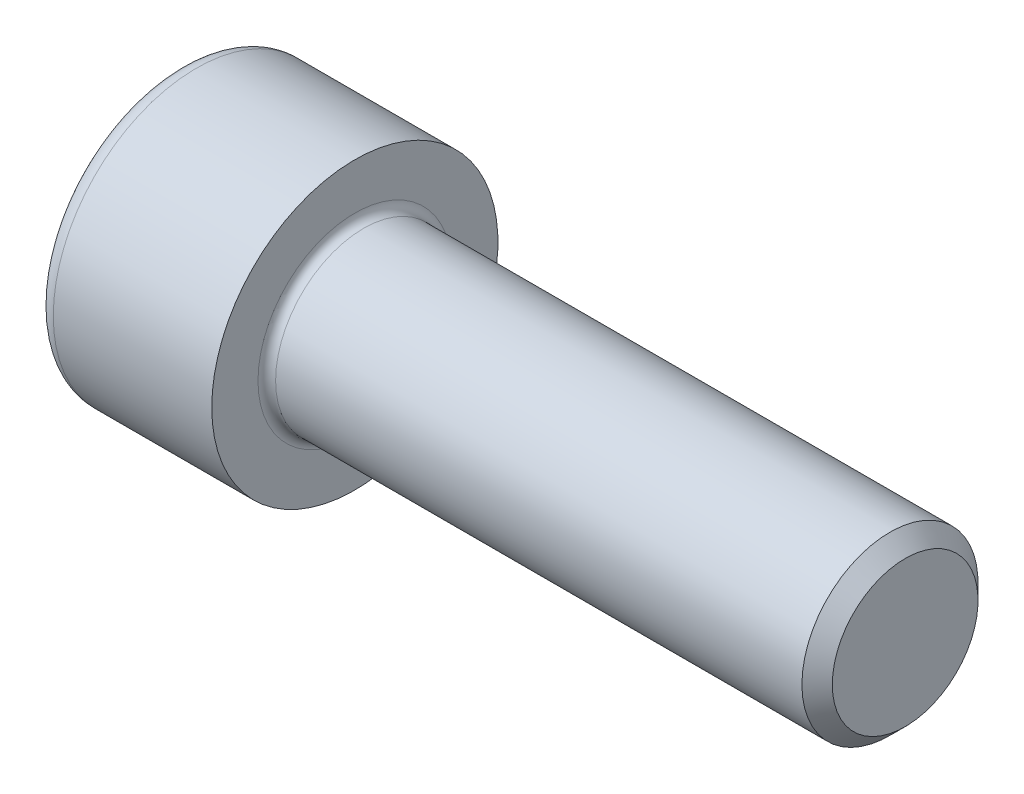
ISO-10303-21;
HEADER;
FILE_DESCRIPTION(('STEP AP214'),'2;1');
FILE_NAME('part.step','',(''),(''),'','','');
FILE_SCHEMA(('AUTOMOTIVE_DESIGN { 1 0 10303 214 1 1 1 1 }'));
ENDSEC;
DATA;
#1=APPLICATION_CONTEXT('core data for automotive mechanical design processes');
#2=APPLICATION_PROTOCOL_DEFINITION('international standard','automotive_design',2000,#1);
#3=PRODUCT_CONTEXT('',#1,'mechanical');
#4=PRODUCT('Part','Part','',(#3));
#5=PRODUCT_RELATED_PRODUCT_CATEGORY('part','',(#4));
#6=PRODUCT_DEFINITION_FORMATION('','',#4);
#7=PRODUCT_DEFINITION_CONTEXT('part definition',#1,'design');
#8=PRODUCT_DEFINITION('design','',#6,#7);
#9=PRODUCT_DEFINITION_SHAPE('','',#8);
#10=(LENGTH_UNIT() NAMED_UNIT(*) SI_UNIT(.MILLI.,.METRE.));
#11=(NAMED_UNIT(*) PLANE_ANGLE_UNIT() SI_UNIT($,.RADIAN.));
#12=(NAMED_UNIT(*) SI_UNIT($,.STERADIAN.) SOLID_ANGLE_UNIT());
#13=UNCERTAINTY_MEASURE_WITH_UNIT(LENGTH_MEASURE(1.E-05),#10,'distance_accuracy_value','');
#14=(GEOMETRIC_REPRESENTATION_CONTEXT(3) GLOBAL_UNCERTAINTY_ASSIGNED_CONTEXT((#13)) GLOBAL_UNIT_ASSIGNED_CONTEXT((#10,
#11,#12)) REPRESENTATION_CONTEXT('',''));
#15=CARTESIAN_POINT('',(0.,0.,0.));
#16=DIRECTION('',(0.,0.,1.));
#17=DIRECTION('',(1.,0.,0.));
#18=AXIS2_PLACEMENT_3D('',#15,#16,#17);
#19=CARTESIAN_POINT('',(0.,0.,0.));
#20=DIRECTION('',(-1.,0.,0.));
#21=DIRECTION('',(0.,0.,1.));
#22=AXIS2_PLACEMENT_3D('',#19,#20,#21);
#23=PLANE('',#22);
#24=DIRECTION('',(0.,-0.499999999999999,0.866025403784439));
#25=VECTOR('',#24,1.);
#26=CARTESIAN_POINT('',(0.,3.47564862052154,0.));
#27=LINE('',#26,#25);
#28=CARTESIAN_POINT('',(0.,3.47564862052154,0.));
#29=VERTEX_POINT('',#28);
#30=CARTESIAN_POINT('',(0.,1.73782431026077,3.01));
#31=VERTEX_POINT('',#30);
#32=EDGE_CURVE('E257',#29,#31,#27,.T.);
#33=ORIENTED_EDGE('',*,*,#32,.T.);
#34=DIRECTION('',(0.,1.,0.));
#35=VECTOR('',#34,1.);
#36=CARTESIAN_POINT('',(0.,-1.73782431026078,3.01));
#37=LINE('',#36,#35);
#38=CARTESIAN_POINT('',(0.,-1.73782431026078,3.01));
#39=VERTEX_POINT('',#38);
#40=EDGE_CURVE('E129',#39,#31,#37,.T.);
#41=ORIENTED_EDGE('',*,*,#40,.F.);
#42=DIRECTION('',(0.,-0.500000000000001,-0.866025403784438));
#43=VECTOR('',#42,1.);
#44=CARTESIAN_POINT('',(0.,-1.73782431026078,3.01));
#45=LINE('',#44,#43);
#46=CARTESIAN_POINT('',(0.,-3.47564862052155,0.));
#47=VERTEX_POINT('',#46);
#48=EDGE_CURVE('E260',#39,#47,#45,.T.);
#49=ORIENTED_EDGE('',*,*,#48,.T.);
#50=DIRECTION('',(0.,0.499999999999999,-0.866025403784439));
#51=VECTOR('',#50,1.);
#52=CARTESIAN_POINT('',(0.,-3.47564862052155,0.));
#53=LINE('',#52,#51);
#54=CARTESIAN_POINT('',(0.,-1.73782431026078,-3.01));
#55=VERTEX_POINT('',#54);
#56=EDGE_CURVE('E263',#47,#55,#53,.T.);
#57=ORIENTED_EDGE('',*,*,#56,.T.);
#58=DIRECTION('',(0.,-1.,0.));
#59=VECTOR('',#58,1.);
#60=CARTESIAN_POINT('',(0.,1.73782431026076,-3.01));
#61=LINE('',#60,#59);
#62=CARTESIAN_POINT('',(0.,1.73782431026076,-3.01));
#63=VERTEX_POINT('',#62);
#64=EDGE_CURVE('E266',#63,#55,#61,.T.);
#65=ORIENTED_EDGE('',*,*,#64,.F.);
#66=DIRECTION('',(0.,-0.500000000000001,-0.866025403784438));
#67=VECTOR('',#66,1.);
#68=CARTESIAN_POINT('',(0.,3.47564862052154,0.));
#69=LINE('',#68,#67);
#70=EDGE_CURVE('E124',#29,#63,#69,.T.);
#71=ORIENTED_EDGE('',*,*,#70,.F.);
#72=EDGE_LOOP('',(#33,#41,#49,#57,#65,#71));
#73=FACE_BOUND('',#72,.T.);
#74=CARTESIAN_POINT('',(0.,0.,0.));
#75=DIRECTION('',(-1.,0.,0.));
#76=DIRECTION('',(0.,0.,1.));
#77=AXIS2_PLACEMENT_3D('',#74,#75,#76);
#78=CIRCLE('',#77,5.7);
#79=CARTESIAN_POINT('',(0.,0.,5.7));
#80=VERTEX_POINT('',#79);
#81=EDGE_CURVE('E41',#80,#80,#78,.T.);
#82=ORIENTED_EDGE('',*,*,#81,.T.);
#83=EDGE_LOOP('',(#82));
#84=FACE_BOUND('',#83,.T.);
#85=ADVANCED_FACE('F33',(#73,#84),#23,.T.);
#86=CARTESIAN_POINT('',(-31.75,0.,0.));
#87=DIRECTION('',(-1.,0.,0.));
#88=DIRECTION('',(0.,0.,1.));
#89=AXIS2_PLACEMENT_3D('',#86,#87,#88);
#90=CYLINDRICAL_SURFACE('',#89,6.5);
#91=CARTESIAN_POINT('',(0.800000000000002,0.,0.));
#92=DIRECTION('',(-1.,0.,0.));
#93=DIRECTION('',(0.,0.,1.));
#94=AXIS2_PLACEMENT_3D('',#91,#92,#93);
#95=CIRCLE('',#94,6.5);
#96=CARTESIAN_POINT('',(0.800000000000002,0.,6.5));
#97=VERTEX_POINT('',#96);
#98=EDGE_CURVE('E11',#97,#97,#95,.F.);
#99=ORIENTED_EDGE('',*,*,#98,.T.);
#100=EDGE_LOOP('',(#99));
#101=FACE_BOUND('',#100,.T.);
#102=CARTESIAN_POINT('',(8.,0.,0.));
#103=DIRECTION('',(-1.,0.,0.));
#104=DIRECTION('',(0.,0.,1.));
#105=AXIS2_PLACEMENT_3D('',#102,#103,#104);
#106=CIRCLE('',#105,6.5);
#107=CARTESIAN_POINT('',(8.,0.,6.5));
#108=VERTEX_POINT('',#107);
#109=EDGE_CURVE('E147',#108,#108,#106,.T.);
#110=ORIENTED_EDGE('',*,*,#109,.T.);
#111=EDGE_LOOP('',(#110));
#112=FACE_BOUND('',#111,.T.);
#113=ADVANCED_FACE('F171',(#101,#112),#90,.T.);
#114=CARTESIAN_POINT('',(8.,6.5,0.));
#115=DIRECTION('',(1.,0.,0.));
#116=DIRECTION('',(0.,0.,-1.));
#117=AXIS2_PLACEMENT_3D('',#114,#115,#116);
#118=PLANE('',#117);
#119=CARTESIAN_POINT('',(8.,0.,0.));
#120=DIRECTION('',(1.,0.,0.));
#121=DIRECTION('',(0.,0.,-1.));
#122=AXIS2_PLACEMENT_3D('',#119,#120,#121);
#123=CIRCLE('',#122,4.4);
#124=CARTESIAN_POINT('',(8.,0.,-4.4));
#125=VERTEX_POINT('',#124);
#126=EDGE_CURVE('E150',#125,#125,#123,.F.);
#127=ORIENTED_EDGE('',*,*,#126,.T.);
#128=EDGE_LOOP('',(#127));
#129=FACE_BOUND('',#128,.T.);
#130=ORIENTED_EDGE('',*,*,#109,.F.);
#131=EDGE_LOOP('',(#130));
#132=FACE_BOUND('',#131,.T.);
#133=ADVANCED_FACE('F177',(#129,#132),#118,.T.);
#134=CARTESIAN_POINT('',(-31.75,0.,0.));
#135=DIRECTION('',(-1.,0.,0.));
#136=DIRECTION('',(0.,0.,1.));
#137=AXIS2_PLACEMENT_3D('',#134,#135,#136);
#138=CYLINDRICAL_SURFACE('',#137,4.);
#139=CARTESIAN_POINT('',(8.4,0.,0.));
#140=DIRECTION('',(1.,0.,0.));
#141=DIRECTION('',(0.,0.,-1.));
#142=AXIS2_PLACEMENT_3D('',#139,#140,#141);
#143=CIRCLE('',#142,4.);
#144=CARTESIAN_POINT('',(8.4,0.,-4.));
#145=VERTEX_POINT('',#144);
#146=EDGE_CURVE('E153',#145,#145,#143,.T.);
#147=ORIENTED_EDGE('',*,*,#146,.T.);
#148=EDGE_LOOP('',(#147));
#149=FACE_BOUND('',#148,.T.);
#150=CARTESIAN_POINT('',(32.3095,0.,0.));
#151=DIRECTION('',(-1.,0.,0.));
#152=DIRECTION('',(0.,0.,1.));
#153=AXIS2_PLACEMENT_3D('',#150,#151,#152);
#154=CIRCLE('',#153,4.);
#155=CARTESIAN_POINT('',(32.3095,0.,4.));
#156=VERTEX_POINT('',#155);
#157=EDGE_CURVE('E144',#156,#156,#154,.T.);
#158=ORIENTED_EDGE('',*,*,#157,.T.);
#159=EDGE_LOOP('',(#158));
#160=FACE_BOUND('',#159,.T.);
#161=ADVANCED_FACE('F183',(#149,#160),#138,.T.);
#162=CARTESIAN_POINT('',(33.,0.,0.));
#163=DIRECTION('',(-1.,0.,0.));
#164=DIRECTION('',(0.,0.,1.));
#165=AXIS2_PLACEMENT_3D('',#162,#163,#164);
#166=CONICAL_SURFACE('',#165,3.3095,0.78539816339745);
#167=ORIENTED_EDGE('',*,*,#157,.F.);
#168=EDGE_LOOP('',(#167));
#169=FACE_BOUND('',#168,.T.);
#170=CARTESIAN_POINT('',(33.,0.,0.));
#171=DIRECTION('',(-1.,0.,0.));
#172=DIRECTION('',(0.,0.,1.));
#173=AXIS2_PLACEMENT_3D('',#170,#171,#172);
#174=CIRCLE('',#173,3.3095);
#175=CARTESIAN_POINT('',(33.,0.,3.3095));
#176=VERTEX_POINT('',#175);
#177=EDGE_CURVE('E140',#176,#176,#174,.T.);
#178=ORIENTED_EDGE('',*,*,#177,.T.);
#179=EDGE_LOOP('',(#178));
#180=FACE_BOUND('',#179,.T.);
#181=ADVANCED_FACE('F187',(#169,#180),#166,.T.);
#182=CARTESIAN_POINT('',(33.,3.3095,0.));
#183=DIRECTION('',(1.,0.,0.));
#184=DIRECTION('',(0.,0.,-1.));
#185=AXIS2_PLACEMENT_3D('',#182,#183,#184);
#186=PLANE('',#185);
#187=ORIENTED_EDGE('',*,*,#177,.F.);
#188=EDGE_LOOP('',(#187));
#189=FACE_BOUND('',#188,.T.);
#190=ADVANCED_FACE('F167',(#189),#186,.T.);
#191=CARTESIAN_POINT('',(8.4,0.,0.));
#192=DIRECTION('',(1.,0.,0.));
#193=DIRECTION('',(0.,0.,-1.));
#194=AXIS2_PLACEMENT_3D('',#191,#192,#193);
#195=TOROIDAL_SURFACE('',#194,4.4,0.4);
#196=ORIENTED_EDGE('',*,*,#146,.F.);
#197=EDGE_LOOP('',(#196));
#198=FACE_BOUND('',#197,.T.);
#199=ORIENTED_EDGE('',*,*,#126,.F.);
#200=EDGE_LOOP('',(#199));
#201=FACE_BOUND('',#200,.T.);
#202=ADVANCED_FACE('F160',(#198,#201),#195,.F.);
#203=CARTESIAN_POINT('',(0.800000000000002,0.,0.));
#204=DIRECTION('',(-1.,0.,0.));
#205=DIRECTION('',(0.,0.,1.));
#206=AXIS2_PLACEMENT_3D('',#203,#204,#205);
#207=TOROIDAL_SURFACE('',#206,5.7,0.8);
#208=ORIENTED_EDGE('',*,*,#98,.F.);
#209=EDGE_LOOP('',(#208));
#210=FACE_BOUND('',#209,.T.);
#211=ORIENTED_EDGE('',*,*,#81,.F.);
#212=EDGE_LOOP('',(#211));
#213=FACE_BOUND('',#212,.T.);
#214=ADVANCED_FACE('F35',(#210,#213),#207,.T.);
#215=CARTESIAN_POINT('',(4.,3.47564862052154,0.));
#216=DIRECTION('',(0.,-0.866025403784439,-0.499999999999999));
#217=DIRECTION('',(0.,0.499999999999999,-0.866025403784439));
#218=AXIS2_PLACEMENT_3D('',#215,#216,#217);
#219=PLANE('',#218);
#220=ORIENTED_EDGE('',*,*,#32,.F.);
#221=DIRECTION('',(-1.,0.,0.));
#222=VECTOR('',#221,1.);
#223=CARTESIAN_POINT('',(4.,3.47564862052154,0.));
#224=LINE('',#223,#222);
#225=CARTESIAN_POINT('',(4.,3.47564862052154,0.));
#226=VERTEX_POINT('',#225);
#227=EDGE_CURVE('E247',#226,#29,#224,.T.);
#228=ORIENTED_EDGE('',*,*,#227,.F.);
#229=DIRECTION('',(0.,-0.499999999999999,0.866025403784439));
#230=VECTOR('',#229,1.);
#231=CARTESIAN_POINT('',(4.,3.47564862052154,0.));
#232=LINE('',#231,#230);
#233=CARTESIAN_POINT('',(4.,2.60673646539116,1.505));
#234=VERTEX_POINT('',#233);
#235=EDGE_CURVE('E116',#226,#234,#232,.T.);
#236=ORIENTED_EDGE('',*,*,#235,.T.);
#237=CARTESIAN_POINT('',(4.,1.73782431026077,3.01));
#238=VERTEX_POINT('',#237);
#239=EDGE_CURVE('E107',#234,#238,#232,.T.);
#240=ORIENTED_EDGE('',*,*,#239,.T.);
#241=DIRECTION('',(-1.,0.,0.));
#242=VECTOR('',#241,1.);
#243=CARTESIAN_POINT('',(4.,1.73782431026077,3.01));
#244=LINE('',#243,#242);
#245=EDGE_CURVE('E121',#238,#31,#244,.T.);
#246=ORIENTED_EDGE('',*,*,#245,.T.);
#247=EDGE_LOOP('',(#220,#228,#236,#240,#246));
#248=FACE_BOUND('',#247,.T.);
#249=ADVANCED_FACE('F120',(#248),#219,.T.);
#250=CARTESIAN_POINT('',(4.,-1.73782431026078,3.01));
#251=DIRECTION('',(0.,0.,1.));
#252=DIRECTION('',(0.,-1.,0.));
#253=AXIS2_PLACEMENT_3D('',#250,#251,#252);
#254=PLANE('',#253);
#255=ORIENTED_EDGE('',*,*,#40,.T.);
#256=ORIENTED_EDGE('',*,*,#245,.F.);
#257=DIRECTION('',(0.,1.,0.));
#258=VECTOR('',#257,1.);
#259=CARTESIAN_POINT('',(4.,-1.73782431026078,3.01));
#260=LINE('',#259,#258);
#261=CARTESIAN_POINT('',(4.,0.,3.01));
#262=VERTEX_POINT('',#261);
#263=EDGE_CURVE('E104',#262,#238,#260,.T.);
#264=ORIENTED_EDGE('',*,*,#263,.F.);
#265=CARTESIAN_POINT('',(4.,-1.73782431026078,3.01));
#266=VERTEX_POINT('',#265);
#267=EDGE_CURVE('E115',#266,#262,#260,.T.);
#268=ORIENTED_EDGE('',*,*,#267,.F.);
#269=DIRECTION('',(-1.,0.,0.));
#270=VECTOR('',#269,1.);
#271=CARTESIAN_POINT('',(4.,-1.73782431026078,3.01));
#272=LINE('',#271,#270);
#273=EDGE_CURVE('E131',#266,#39,#272,.T.);
#274=ORIENTED_EDGE('',*,*,#273,.T.);
#275=EDGE_LOOP('',(#255,#256,#264,#268,#274));
#276=FACE_BOUND('',#275,.T.);
#277=ADVANCED_FACE('F126',(#276),#254,.F.);
#278=CARTESIAN_POINT('',(4.,-1.73782431026078,3.01));
#279=DIRECTION('',(0.,0.866025403784438,-0.500000000000001));
#280=DIRECTION('',(0.,0.500000000000001,0.866025403784438));
#281=AXIS2_PLACEMENT_3D('',#278,#279,#280);
#282=PLANE('',#281);
#283=ORIENTED_EDGE('',*,*,#48,.F.);
#284=ORIENTED_EDGE('',*,*,#273,.F.);
#285=DIRECTION('',(0.,-0.500000000000001,-0.866025403784438));
#286=VECTOR('',#285,1.);
#287=CARTESIAN_POINT('',(4.,-1.73782431026078,3.01));
#288=LINE('',#287,#286);
#289=CARTESIAN_POINT('',(4.,-2.60673646539116,1.50500000000001));
#290=VERTEX_POINT('',#289);
#291=EDGE_CURVE('E286',#266,#290,#288,.T.);
#292=ORIENTED_EDGE('',*,*,#291,.T.);
#293=CARTESIAN_POINT('',(4.,-3.47564862052155,0.));
#294=VERTEX_POINT('',#293);
#295=EDGE_CURVE('E275',#290,#294,#288,.T.);
#296=ORIENTED_EDGE('',*,*,#295,.T.);
#297=DIRECTION('',(-1.,0.,0.));
#298=VECTOR('',#297,1.);
#299=CARTESIAN_POINT('',(4.,-3.47564862052155,0.));
#300=LINE('',#299,#298);
#301=EDGE_CURVE('E136',#294,#47,#300,.T.);
#302=ORIENTED_EDGE('',*,*,#301,.T.);
#303=EDGE_LOOP('',(#283,#284,#292,#296,#302));
#304=FACE_BOUND('',#303,.T.);
#305=ADVANCED_FACE('F201',(#304),#282,.T.);
#306=CARTESIAN_POINT('',(4.,-3.47564862052155,0.));
#307=DIRECTION('',(0.,0.866025403784439,0.499999999999999));
#308=DIRECTION('',(0.,-0.499999999999999,0.866025403784439));
#309=AXIS2_PLACEMENT_3D('',#306,#307,#308);
#310=PLANE('',#309);
#311=ORIENTED_EDGE('',*,*,#56,.F.);
#312=ORIENTED_EDGE('',*,*,#301,.F.);
#313=DIRECTION('',(0.,0.499999999999999,-0.866025403784439));
#314=VECTOR('',#313,1.);
#315=CARTESIAN_POINT('',(4.,-3.47564862052155,0.));
#316=LINE('',#315,#314);
#317=CARTESIAN_POINT('',(4.,-2.60673646539117,-1.505));
#318=VERTEX_POINT('',#317);
#319=EDGE_CURVE('E253',#294,#318,#316,.T.);
#320=ORIENTED_EDGE('',*,*,#319,.T.);
#321=CARTESIAN_POINT('',(4.,-1.73782431026078,-3.01));
#322=VERTEX_POINT('',#321);
#323=EDGE_CURVE('E285',#318,#322,#316,.T.);
#324=ORIENTED_EDGE('',*,*,#323,.T.);
#325=DIRECTION('',(-1.,0.,0.));
#326=VECTOR('',#325,1.);
#327=CARTESIAN_POINT('',(4.,-1.73782431026078,-3.01));
#328=LINE('',#327,#326);
#329=EDGE_CURVE('E246',#322,#55,#328,.T.);
#330=ORIENTED_EDGE('',*,*,#329,.T.);
#331=EDGE_LOOP('',(#311,#312,#320,#324,#330));
#332=FACE_BOUND('',#331,.T.);
#333=ADVANCED_FACE('F204',(#332),#310,.T.);
#334=CARTESIAN_POINT('',(4.,1.73782431026076,-3.01));
#335=DIRECTION('',(0.,0.,-1.));
#336=DIRECTION('',(0.,1.,0.));
#337=AXIS2_PLACEMENT_3D('',#334,#335,#336);
#338=PLANE('',#337);
#339=ORIENTED_EDGE('',*,*,#64,.T.);
#340=ORIENTED_EDGE('',*,*,#329,.F.);
#341=DIRECTION('',(0.,-1.,0.));
#342=VECTOR('',#341,1.);
#343=CARTESIAN_POINT('',(4.,1.73782431026076,-3.01));
#344=LINE('',#343,#342);
#345=CARTESIAN_POINT('',(4.,0.,-3.01));
#346=VERTEX_POINT('',#345);
#347=EDGE_CURVE('E250',#346,#322,#344,.T.);
#348=ORIENTED_EDGE('',*,*,#347,.F.);
#349=CARTESIAN_POINT('',(4.,1.73782431026076,-3.01));
#350=VERTEX_POINT('',#349);
#351=EDGE_CURVE('E48',#350,#346,#344,.T.);
#352=ORIENTED_EDGE('',*,*,#351,.F.);
#353=DIRECTION('',(-1.,0.,0.));
#354=VECTOR('',#353,1.);
#355=CARTESIAN_POINT('',(4.,1.73782431026076,-3.01));
#356=LINE('',#355,#354);
#357=EDGE_CURVE('E243',#350,#63,#356,.T.);
#358=ORIENTED_EDGE('',*,*,#357,.T.);
#359=EDGE_LOOP('',(#339,#340,#348,#352,#358));
#360=FACE_BOUND('',#359,.T.);
#361=ADVANCED_FACE('F208',(#360),#338,.F.);
#362=CARTESIAN_POINT('',(4.,3.47564862052154,0.));
#363=DIRECTION('',(0.,0.866025403784438,-0.500000000000001));
#364=DIRECTION('',(0.,0.500000000000001,0.866025403784438));
#365=AXIS2_PLACEMENT_3D('',#362,#363,#364);
#366=PLANE('',#365);
#367=ORIENTED_EDGE('',*,*,#70,.T.);
#368=ORIENTED_EDGE('',*,*,#357,.F.);
#369=DIRECTION('',(0.,-0.500000000000001,-0.866025403784438));
#370=VECTOR('',#369,1.);
#371=CARTESIAN_POINT('',(4.,3.47564862052154,0.));
#372=LINE('',#371,#370);
#373=CARTESIAN_POINT('',(4.,2.60673646539115,-1.505));
#374=VERTEX_POINT('',#373);
#375=EDGE_CURVE('E233',#374,#350,#372,.T.);
#376=ORIENTED_EDGE('',*,*,#375,.F.);
#377=EDGE_CURVE('E239',#226,#374,#372,.T.);
#378=ORIENTED_EDGE('',*,*,#377,.F.);
#379=ORIENTED_EDGE('',*,*,#227,.T.);
#380=EDGE_LOOP('',(#367,#368,#376,#378,#379));
#381=FACE_BOUND('',#380,.T.);
#382=ADVANCED_FACE('F212',(#381),#366,.F.);
#383=CARTESIAN_POINT('',(4.,3.47564862052154,0.));
#384=DIRECTION('',(1.,0.,0.));
#385=DIRECTION('',(0.,0.,-1.));
#386=AXIS2_PLACEMENT_3D('',#383,#384,#385);
#387=PLANE('',#386);
#388=ORIENTED_EDGE('',*,*,#347,.T.);
#389=ORIENTED_EDGE('',*,*,#323,.F.);
#390=CARTESIAN_POINT('',(4.,0.,0.));
#391=DIRECTION('',(-1.,0.,0.));
#392=DIRECTION('',(0.,0.,1.));
#393=AXIS2_PLACEMENT_3D('',#390,#391,#392);
#394=CIRCLE('',#393,3.01);
#395=EDGE_CURVE('E281',#346,#318,#394,.T.);
#396=ORIENTED_EDGE('',*,*,#395,.F.);
#397=EDGE_LOOP('',(#388,#389,#396));
#398=FACE_BOUND('',#397,.T.);
#399=ADVANCED_FACE('F216',(#398),#387,.F.);
#400=ORIENTED_EDGE('',*,*,#319,.F.);
#401=ORIENTED_EDGE('',*,*,#295,.F.);
#402=EDGE_CURVE('E134',#318,#290,#394,.T.);
#403=ORIENTED_EDGE('',*,*,#402,.F.);
#404=EDGE_LOOP('',(#400,#401,#403));
#405=FACE_BOUND('',#404,.T.);
#406=ADVANCED_FACE('F219',(#405),#387,.F.);
#407=ORIENTED_EDGE('',*,*,#291,.F.);
#408=ORIENTED_EDGE('',*,*,#267,.T.);
#409=EDGE_CURVE('E130',#290,#262,#394,.T.);
#410=ORIENTED_EDGE('',*,*,#409,.F.);
#411=EDGE_LOOP('',(#407,#408,#410));
#412=FACE_BOUND('',#411,.T.);
#413=ADVANCED_FACE('F224',(#412),#387,.F.);
#414=ORIENTED_EDGE('',*,*,#263,.T.);
#415=ORIENTED_EDGE('',*,*,#239,.F.);
#416=EDGE_CURVE('E110',#262,#234,#394,.T.);
#417=ORIENTED_EDGE('',*,*,#416,.F.);
#418=EDGE_LOOP('',(#414,#415,#417));
#419=FACE_BOUND('',#418,.T.);
#420=ADVANCED_FACE('F106',(#419),#387,.F.);
#421=ORIENTED_EDGE('',*,*,#235,.F.);
#422=ORIENTED_EDGE('',*,*,#377,.T.);
#423=EDGE_CURVE('E141',#234,#374,#394,.T.);
#424=ORIENTED_EDGE('',*,*,#423,.F.);
#425=EDGE_LOOP('',(#421,#422,#424));
#426=FACE_BOUND('',#425,.T.);
#427=ADVANCED_FACE('F227',(#426),#387,.F.);
#428=ORIENTED_EDGE('',*,*,#375,.T.);
#429=ORIENTED_EDGE('',*,*,#351,.T.);
#430=EDGE_CURVE('E236',#374,#346,#394,.T.);
#431=ORIENTED_EDGE('',*,*,#430,.F.);
#432=EDGE_LOOP('',(#428,#429,#431));
#433=FACE_BOUND('',#432,.T.);
#434=ADVANCED_FACE('F197',(#433),#387,.F.);
#435=CARTESIAN_POINT('',(4.,0.,0.));
#436=DIRECTION('',(-1.,0.,0.));
#437=DIRECTION('',(0.,0.,1.));
#438=AXIS2_PLACEMENT_3D('',#435,#436,#437);
#439=CONICAL_SURFACE('',#438,3.01,1.04719755119659);
#440=CARTESIAN_POINT('',(5.73782431026079,0.,0.));
#441=VERTEX_POINT('',#440);
#442=VERTEX_LOOP('',#441);
#443=FACE_BOUND('',#442,.T.);
#444=ORIENTED_EDGE('',*,*,#416,.T.);
#445=ORIENTED_EDGE('',*,*,#423,.T.);
#446=ORIENTED_EDGE('',*,*,#430,.T.);
#447=ORIENTED_EDGE('',*,*,#395,.T.);
#448=ORIENTED_EDGE('',*,*,#402,.T.);
#449=ORIENTED_EDGE('',*,*,#409,.T.);
#450=EDGE_LOOP('',(#444,#445,#446,#447,#448,#449));
#451=FACE_BOUND('',#450,.T.);
#452=ADVANCED_FACE('F195',(#443,#451),#439,.F.);
#453=CLOSED_SHELL('',(#85,#113,#133,#161,#181,#190,#202,#214,#249,#277,#305,#333,#361,#382,#399,
#406,#413,#420,#427,#434,#452));
#454=MANIFOLD_SOLID_BREP('B2',#453);
#455=ADVANCED_BREP_SHAPE_REPRESENTATION('',(#18,#454),#14);
#456=SHAPE_DEFINITION_REPRESENTATION(#9,#455);
ENDSEC;
END-ISO-10303-21;
